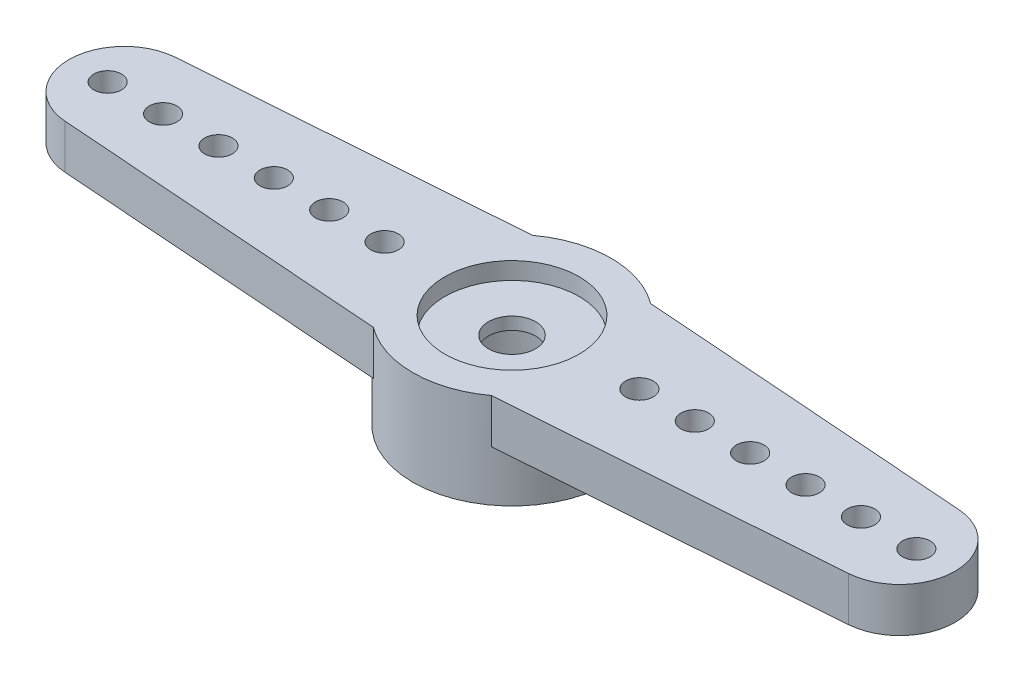
ISO-10303-21;
HEADER;
FILE_DESCRIPTION(('STEP AP214'),'2;1');
FILE_NAME('part.step','',(''),(''),'','','');
FILE_SCHEMA(('AUTOMOTIVE_DESIGN { 1 0 10303 214 1 1 1 1 }'));
ENDSEC;
DATA;
#1=APPLICATION_CONTEXT('core data for automotive mechanical design processes');
#2=APPLICATION_PROTOCOL_DEFINITION('international standard','automotive_design',2000,#1);
#3=PRODUCT_CONTEXT('',#1,'mechanical');
#4=PRODUCT('Part','Part','',(#3));
#5=PRODUCT_RELATED_PRODUCT_CATEGORY('part','',(#4));
#6=PRODUCT_DEFINITION_FORMATION('','',#4);
#7=PRODUCT_DEFINITION_CONTEXT('part definition',#1,'design');
#8=PRODUCT_DEFINITION('design','',#6,#7);
#9=PRODUCT_DEFINITION_SHAPE('','',#8);
#10=(LENGTH_UNIT() NAMED_UNIT(*) SI_UNIT(.MILLI.,.METRE.));
#11=(NAMED_UNIT(*) PLANE_ANGLE_UNIT() SI_UNIT($,.RADIAN.));
#12=(NAMED_UNIT(*) SI_UNIT($,.STERADIAN.) SOLID_ANGLE_UNIT());
#13=UNCERTAINTY_MEASURE_WITH_UNIT(LENGTH_MEASURE(1.E-05),#10,'distance_accuracy_value','');
#14=(GEOMETRIC_REPRESENTATION_CONTEXT(3) GLOBAL_UNCERTAINTY_ASSIGNED_CONTEXT((#13)) GLOBAL_UNIT_ASSIGNED_CONTEXT((#10,
#11,#12)) REPRESENTATION_CONTEXT('',''));
#15=CARTESIAN_POINT('',(0.,0.,0.));
#16=DIRECTION('',(0.,0.,1.));
#17=DIRECTION('',(1.,0.,0.));
#18=AXIS2_PLACEMENT_3D('',#15,#16,#17);
#19=CARTESIAN_POINT('',(3.554,13.2,-3.6));
#20=DIRECTION('',(0.,-1.,0.));
#21=DIRECTION('',(0.,0.,-1.));
#22=AXIS2_PLACEMENT_3D('',#19,#20,#21);
#23=PLANE('',#22);
#24=CARTESIAN_POINT('',(5.9,13.2,-5.9));
#25=DIRECTION('',(0.,1.,0.));
#26=DIRECTION('',(0.,0.,1.));
#27=AXIS2_PLACEMENT_3D('',#24,#25,#26);
#28=CIRCLE('',#27,0.850000000000001);
#29=CARTESIAN_POINT('',(5.9,13.2,-5.05));
#30=VERTEX_POINT('',#29);
#31=EDGE_CURVE('E286',#30,#30,#28,.F.);
#32=ORIENTED_EDGE('',*,*,#31,.F.);
#33=EDGE_LOOP('',(#32));
#34=FACE_BOUND('',#33,.T.);
#35=CARTESIAN_POINT('',(5.9,13.2,-5.9));
#36=DIRECTION('',(0.,-1.,0.));
#37=DIRECTION('',(0.,0.,-1.));
#38=AXIS2_PLACEMENT_3D('',#35,#36,#37);
#39=CIRCLE('',#38,2.3);
#40=CARTESIAN_POINT('',(5.9,13.2,-8.2));
#41=VERTEX_POINT('',#40);
#42=EDGE_CURVE('E29',#41,#41,#39,.F.);
#43=ORIENTED_EDGE('',*,*,#42,.F.);
#44=EDGE_LOOP('',(#43));
#45=FACE_BOUND('',#44,.T.);
#46=ADVANCED_FACE('F25',(#34,#45),#23,.T.);
#47=CARTESIAN_POINT('',(5.9,13.2,-5.9));
#48=DIRECTION('',(0.,-1.,0.));
#49=DIRECTION('',(0.,0.,-1.));
#50=AXIS2_PLACEMENT_3D('',#47,#48,#49);
#51=CYLINDRICAL_SURFACE('',#50,2.3);
#52=ORIENTED_EDGE('',*,*,#42,.T.);
#53=EDGE_LOOP('',(#52));
#54=FACE_BOUND('',#53,.T.);
#55=CARTESIAN_POINT('',(5.9,10.84,-5.9));
#56=DIRECTION('',(0.,-1.,0.));
#57=DIRECTION('',(0.,0.,-1.));
#58=AXIS2_PLACEMENT_3D('',#55,#56,#57);
#59=CIRCLE('',#58,2.3);
#60=CARTESIAN_POINT('',(5.9,10.84,-8.2));
#61=VERTEX_POINT('',#60);
#62=EDGE_CURVE('E283',#61,#61,#59,.F.);
#63=ORIENTED_EDGE('',*,*,#62,.F.);
#64=EDGE_LOOP('',(#63));
#65=FACE_BOUND('',#64,.T.);
#66=ADVANCED_FACE('F295',(#54,#65),#51,.F.);
#67=CARTESIAN_POINT('',(5.9,13.2,-5.9));
#68=DIRECTION('',(0.,1.,0.));
#69=DIRECTION('',(0.,0.,1.));
#70=AXIS2_PLACEMENT_3D('',#67,#68,#69);
#71=CYLINDRICAL_SURFACE('',#70,0.850000000000001);
#72=ORIENTED_EDGE('',*,*,#31,.T.);
#73=EDGE_LOOP('',(#72));
#74=FACE_BOUND('',#73,.T.);
#75=CARTESIAN_POINT('',(5.9,13.65,-5.9));
#76=DIRECTION('',(0.,1.,0.));
#77=DIRECTION('',(0.,0.,1.));
#78=AXIS2_PLACEMENT_3D('',#75,#76,#77);
#79=CIRCLE('',#78,0.850000000000001);
#80=CARTESIAN_POINT('',(5.9,13.65,-5.05));
#81=VERTEX_POINT('',#80);
#82=EDGE_CURVE('E278',#81,#81,#79,.F.);
#83=ORIENTED_EDGE('',*,*,#82,.F.);
#84=EDGE_LOOP('',(#83));
#85=FACE_BOUND('',#84,.T.);
#86=ADVANCED_FACE('F305',(#74,#85),#71,.F.);
#87=CARTESIAN_POINT('',(2.2484,10.84,-2.2484));
#88=DIRECTION('',(0.,-1.,0.));
#89=DIRECTION('',(0.,0.,-1.));
#90=AXIS2_PLACEMENT_3D('',#87,#88,#89);
#91=PLANE('',#90);
#92=ORIENTED_EDGE('',*,*,#62,.T.);
#93=EDGE_LOOP('',(#92));
#94=FACE_BOUND('',#93,.T.);
#95=CARTESIAN_POINT('',(5.9,10.84,-5.9));
#96=DIRECTION('',(0.,1.,0.));
#97=DIRECTION('',(0.,0.,1.));
#98=AXIS2_PLACEMENT_3D('',#95,#96,#97);
#99=CIRCLE('',#98,3.58);
#100=CARTESIAN_POINT('',(5.9,10.84,-2.32));
#101=VERTEX_POINT('',#100);
#102=EDGE_CURVE('E101',#101,#101,#99,.T.);
#103=ORIENTED_EDGE('',*,*,#102,.F.);
#104=EDGE_LOOP('',(#103));
#105=FACE_BOUND('',#104,.T.);
#106=ADVANCED_FACE('F471',(#94,#105),#91,.T.);
#107=CARTESIAN_POINT('',(8.03325455583716,12.67,-3.025));
#108=DIRECTION('',(0.,-1.,0.));
#109=DIRECTION('',(0.,0.,-1.));
#110=AXIS2_PLACEMENT_3D('',#107,#108,#109);
#111=PLANE('',#110);
#112=CARTESIAN_POINT('',(10.5,12.67,-5.9));
#113=DIRECTION('',(0.,-1.,0.));
#114=DIRECTION('',(0.,0.,-1.));
#115=AXIS2_PLACEMENT_3D('',#112,#113,#114);
#116=CIRCLE('',#115,0.500000000000001);
#117=CARTESIAN_POINT('',(10.5,12.67,-6.4));
#118=VERTEX_POINT('',#117);
#119=EDGE_CURVE('E112',#118,#118,#116,.T.);
#120=ORIENTED_EDGE('',*,*,#119,.F.);
#121=EDGE_LOOP('',(#120));
#122=FACE_BOUND('',#121,.T.);
#123=CARTESIAN_POINT('',(14.5,12.67,-5.9));
#124=DIRECTION('',(0.,-1.,0.));
#125=DIRECTION('',(0.,0.,-1.));
#126=AXIS2_PLACEMENT_3D('',#123,#124,#125);
#127=CIRCLE('',#126,0.5);
#128=CARTESIAN_POINT('',(14.5,12.67,-6.4));
#129=VERTEX_POINT('',#128);
#130=EDGE_CURVE('E265',#129,#129,#127,.T.);
#131=ORIENTED_EDGE('',*,*,#130,.F.);
#132=EDGE_LOOP('',(#131));
#133=FACE_BOUND('',#132,.T.);
#134=CARTESIAN_POINT('',(18.5,12.67,-5.9));
#135=DIRECTION('',(0.,-1.,0.));
#136=DIRECTION('',(0.,0.,-1.));
#137=AXIS2_PLACEMENT_3D('',#134,#135,#136);
#138=CIRCLE('',#137,0.499999999999999);
#139=CARTESIAN_POINT('',(18.5,12.67,-6.4));
#140=VERTEX_POINT('',#139);
#141=EDGE_CURVE('E261',#140,#140,#138,.T.);
#142=ORIENTED_EDGE('',*,*,#141,.F.);
#143=EDGE_LOOP('',(#142));
#144=FACE_BOUND('',#143,.T.);
#145=CARTESIAN_POINT('',(20.5,12.67,-5.9));
#146=DIRECTION('',(0.,-1.,0.));
#147=DIRECTION('',(0.,0.,-1.));
#148=AXIS2_PLACEMENT_3D('',#145,#146,#147);
#149=CIRCLE('',#148,0.500000000000002);
#150=CARTESIAN_POINT('',(20.5,12.67,-6.4));
#151=VERTEX_POINT('',#150);
#152=EDGE_CURVE('E257',#151,#151,#149,.T.);
#153=ORIENTED_EDGE('',*,*,#152,.F.);
#154=EDGE_LOOP('',(#153));
#155=FACE_BOUND('',#154,.T.);
#156=CARTESIAN_POINT('',(16.5,12.67,-5.9));
#157=DIRECTION('',(0.,-1.,0.));
#158=DIRECTION('',(0.,0.,-1.));
#159=AXIS2_PLACEMENT_3D('',#156,#157,#158);
#160=CIRCLE('',#159,0.5);
#161=CARTESIAN_POINT('',(16.5,12.67,-6.4));
#162=VERTEX_POINT('',#161);
#163=EDGE_CURVE('E253',#162,#162,#160,.T.);
#164=ORIENTED_EDGE('',*,*,#163,.F.);
#165=EDGE_LOOP('',(#164));
#166=FACE_BOUND('',#165,.T.);
#167=CARTESIAN_POINT('',(12.5,12.67,-5.9));
#168=DIRECTION('',(0.,-1.,0.));
#169=DIRECTION('',(0.,0.,-1.));
#170=AXIS2_PLACEMENT_3D('',#167,#168,#169);
#171=CIRCLE('',#170,0.500000000000001);
#172=CARTESIAN_POINT('',(12.5,12.67,-6.4));
#173=VERTEX_POINT('',#172);
#174=EDGE_CURVE('E249',#173,#173,#171,.T.);
#175=ORIENTED_EDGE('',*,*,#174,.F.);
#176=EDGE_LOOP('',(#175));
#177=FACE_BOUND('',#176,.T.);
#178=DIRECTION('',(-0.997325531387097,0.,-0.0730875122264069));
#179=VECTOR('',#178,1.);
#180=CARTESIAN_POINT('',(14.039714790145,12.67,-8.33482553138709));
#181=LINE('',#180,#179);
#182=CARTESIAN_POINT('',(20.0461750244528,12.67,-7.89465106277419));
#183=VERTEX_POINT('',#182);
#184=CARTESIAN_POINT('',(8.03325455583716,12.67,-8.775));
#185=VERTEX_POINT('',#184);
#186=EDGE_CURVE('E95',#183,#185,#181,.T.);
#187=ORIENTED_EDGE('',*,*,#186,.F.);
#188=CARTESIAN_POINT('',(19.9,12.67,-5.9));
#189=DIRECTION('',(0.,1.,0.));
#190=DIRECTION('',(0.,0.,1.));
#191=AXIS2_PLACEMENT_3D('',#188,#189,#190);
#192=CIRCLE('',#191,2.);
#193=CARTESIAN_POINT('',(20.0461750244528,12.67,-3.9053489372258));
#194=VERTEX_POINT('',#193);
#195=EDGE_CURVE('E119',#194,#183,#192,.T.);
#196=ORIENTED_EDGE('',*,*,#195,.F.);
#197=DIRECTION('',(0.997325531387097,0.,-0.0730875122264059));
#198=VECTOR('',#197,1.);
#199=CARTESIAN_POINT('',(14.039714790145,12.67,-3.4651744686129));
#200=LINE('',#199,#198);
#201=CARTESIAN_POINT('',(8.03325455583716,12.67,-3.025));
#202=VERTEX_POINT('',#201);
#203=EDGE_CURVE('E96',#202,#194,#200,.T.);
#204=ORIENTED_EDGE('',*,*,#203,.F.);
#205=CARTESIAN_POINT('',(5.9,12.67,-5.9));
#206=DIRECTION('',(0.,1.,0.));
#207=DIRECTION('',(0.,0.,1.));
#208=AXIS2_PLACEMENT_3D('',#205,#206,#207);
#209=CIRCLE('',#208,3.58);
#210=EDGE_CURVE('E90',#185,#202,#209,.F.);
#211=ORIENTED_EDGE('',*,*,#210,.F.);
#212=EDGE_LOOP('',(#187,#196,#204,#211));
#213=FACE_BOUND('',#212,.T.);
#214=ADVANCED_FACE('F92',(#122,#133,#144,#155,#166,#177,#213),#111,.T.);
#215=CARTESIAN_POINT('',(3.4265,13.65,-8.325));
#216=DIRECTION('',(0.,1.,0.));
#217=DIRECTION('',(0.,0.,1.));
#218=AXIS2_PLACEMENT_3D('',#215,#216,#217);
#219=PLANE('',#218);
#220=ORIENTED_EDGE('',*,*,#82,.T.);
#221=EDGE_LOOP('',(#220));
#222=FACE_BOUND('',#221,.T.);
#223=CARTESIAN_POINT('',(5.9,13.65,-5.9));
#224=DIRECTION('',(0.,-1.,0.));
#225=DIRECTION('',(0.,0.,-1.));
#226=AXIS2_PLACEMENT_3D('',#223,#224,#225);
#227=CIRCLE('',#226,2.425);
#228=CARTESIAN_POINT('',(5.9,13.65,-8.325));
#229=VERTEX_POINT('',#228);
#230=EDGE_CURVE('E245',#229,#229,#227,.T.);
#231=ORIENTED_EDGE('',*,*,#230,.F.);
#232=EDGE_LOOP('',(#231));
#233=FACE_BOUND('',#232,.T.);
#234=ADVANCED_FACE('F366',(#222,#233),#219,.T.);
#235=CARTESIAN_POINT('',(-8.24617502445281,14.27,-7.8946510627742));
#236=DIRECTION('',(-0.0730875122264059,0.,-0.997325531387097));
#237=DIRECTION('',(0.997325531387097,0.,-0.0730875122264059));
#238=AXIS2_PLACEMENT_3D('',#235,#236,#237);
#239=PLANE('',#238);
#240=DIRECTION('',(0.997325531387097,0.,-0.073087512226406));
#241=VECTOR('',#240,1.);
#242=CARTESIAN_POINT('',(-8.2461750244528,12.67,-7.8946510627742));
#243=LINE('',#242,#241);
#244=CARTESIAN_POINT('',(-8.24617502445281,12.67,-7.8946510627742));
#245=VERTEX_POINT('',#244);
#246=CARTESIAN_POINT('',(3.76674544416284,12.67,-8.775));
#247=VERTEX_POINT('',#246);
#248=EDGE_CURVE('E241',#245,#247,#243,.T.);
#249=ORIENTED_EDGE('',*,*,#248,.F.);
#250=DIRECTION('',(0.,-1.,0.));
#251=VECTOR('',#250,1.);
#252=CARTESIAN_POINT('',(-8.24617502445281,13.47,-7.8946510627742));
#253=LINE('',#252,#251);
#254=CARTESIAN_POINT('',(-8.24617502445281,14.27,-7.8946510627742));
#255=VERTEX_POINT('',#254);
#256=EDGE_CURVE('E282',#255,#245,#253,.T.);
#257=ORIENTED_EDGE('',*,*,#256,.F.);
#258=DIRECTION('',(-0.997325531387097,0.,0.073087512226406));
#259=VECTOR('',#258,1.);
#260=CARTESIAN_POINT('',(3.76674544416284,14.27,-8.775));
#261=LINE('',#260,#259);
#262=CARTESIAN_POINT('',(3.76674544416284,14.27,-8.775));
#263=VERTEX_POINT('',#262);
#264=EDGE_CURVE('E203',#263,#255,#261,.T.);
#265=ORIENTED_EDGE('',*,*,#264,.F.);
#266=DIRECTION('',(0.,1.,0.));
#267=VECTOR('',#266,1.);
#268=CARTESIAN_POINT('',(3.76674544416284,12.555,-8.775));
#269=LINE('',#268,#267);
#270=EDGE_CURVE('E123',#247,#263,#269,.T.);
#271=ORIENTED_EDGE('',*,*,#270,.F.);
#272=EDGE_LOOP('',(#249,#257,#265,#271));
#273=FACE_BOUND('',#272,.T.);
#274=ADVANCED_FACE('F361',(#273),#239,.T.);
#275=CARTESIAN_POINT('',(-8.09999999999999,12.67,-5.9));
#276=DIRECTION('',(0.,1.,0.));
#277=DIRECTION('',(0.,0.,1.));
#278=AXIS2_PLACEMENT_3D('',#275,#276,#277);
#279=CYLINDRICAL_SURFACE('',#278,2.);
#280=CARTESIAN_POINT('',(-8.09999999999999,12.67,-5.9));
#281=DIRECTION('',(0.,1.,0.));
#282=DIRECTION('',(0.,0.,1.));
#283=AXIS2_PLACEMENT_3D('',#280,#281,#282);
#284=CIRCLE('',#283,2.);
#285=CARTESIAN_POINT('',(-8.24617502445281,12.67,-3.90534893722581));
#286=VERTEX_POINT('',#285);
#287=EDGE_CURVE('E229',#286,#245,#284,.F.);
#288=ORIENTED_EDGE('',*,*,#287,.F.);
#289=DIRECTION('',(0.,-1.,0.));
#290=VECTOR('',#289,1.);
#291=CARTESIAN_POINT('',(-8.24617502445281,13.47,-3.90534893722581));
#292=LINE('',#291,#290);
#293=CARTESIAN_POINT('',(-8.24617502445281,14.27,-3.90534893722581));
#294=VERTEX_POINT('',#293);
#295=EDGE_CURVE('E277',#294,#286,#292,.T.);
#296=ORIENTED_EDGE('',*,*,#295,.F.);
#297=CARTESIAN_POINT('',(-8.09999999999999,14.27,-5.9));
#298=DIRECTION('',(0.,1.,0.));
#299=DIRECTION('',(0.,0.,1.));
#300=AXIS2_PLACEMENT_3D('',#297,#298,#299);
#301=CIRCLE('',#300,2.);
#302=EDGE_CURVE('E199',#255,#294,#301,.T.);
#303=ORIENTED_EDGE('',*,*,#302,.F.);
#304=ORIENTED_EDGE('',*,*,#256,.T.);
#305=EDGE_LOOP('',(#288,#296,#303,#304));
#306=FACE_BOUND('',#305,.T.);
#307=ADVANCED_FACE('F345',(#306),#279,.T.);
#308=CARTESIAN_POINT('',(3.76674544416284,14.27,-3.025));
#309=DIRECTION('',(-0.0730875122264067,0.,0.997325531387097));
#310=DIRECTION('',(-0.997325531387097,0.,-0.0730875122264067));
#311=AXIS2_PLACEMENT_3D('',#308,#309,#310);
#312=PLANE('',#311);
#313=DIRECTION('',(-0.997325531387097,0.,-0.0730875122264068));
#314=VECTOR('',#313,1.);
#315=CARTESIAN_POINT('',(3.76674544416284,12.67,-3.025));
#316=LINE('',#315,#314);
#317=CARTESIAN_POINT('',(3.76674544416284,12.67,-3.025));
#318=VERTEX_POINT('',#317);
#319=EDGE_CURVE('E233',#318,#286,#316,.T.);
#320=ORIENTED_EDGE('',*,*,#319,.F.);
#321=DIRECTION('',(0.,-1.,0.));
#322=VECTOR('',#321,1.);
#323=CARTESIAN_POINT('',(3.76674544416284,12.555,-3.025));
#324=LINE('',#323,#322);
#325=CARTESIAN_POINT('',(3.76674544416284,14.27,-3.025));
#326=VERTEX_POINT('',#325);
#327=EDGE_CURVE('E100',#326,#318,#324,.T.);
#328=ORIENTED_EDGE('',*,*,#327,.F.);
#329=DIRECTION('',(0.997325531387097,0.,0.0730875122264067));
#330=VECTOR('',#329,1.);
#331=CARTESIAN_POINT('',(-8.2461750244528,14.27,-3.90534893722581));
#332=LINE('',#331,#330);
#333=EDGE_CURVE('E195',#294,#326,#332,.T.);
#334=ORIENTED_EDGE('',*,*,#333,.F.);
#335=ORIENTED_EDGE('',*,*,#295,.T.);
#336=EDGE_LOOP('',(#320,#328,#334,#335));
#337=FACE_BOUND('',#336,.T.);
#338=ADVANCED_FACE('F337',(#337),#312,.T.);
#339=CARTESIAN_POINT('',(5.9,10.84,-5.9));
#340=DIRECTION('',(0.,1.,0.));
#341=DIRECTION('',(0.,0.,1.));
#342=AXIS2_PLACEMENT_3D('',#339,#340,#341);
#343=CYLINDRICAL_SURFACE('',#342,3.58);
#344=CARTESIAN_POINT('',(5.9,14.27,-5.9));
#345=DIRECTION('',(0.,1.,0.));
#346=DIRECTION('',(0.,0.,1.));
#347=AXIS2_PLACEMENT_3D('',#344,#345,#346);
#348=CIRCLE('',#347,3.58);
#349=CARTESIAN_POINT('',(8.03325455583716,14.27,-8.775));
#350=VERTEX_POINT('',#349);
#351=EDGE_CURVE('E108',#350,#263,#348,.T.);
#352=ORIENTED_EDGE('',*,*,#351,.F.);
#353=DIRECTION('',(0.,1.,0.));
#354=VECTOR('',#353,1.);
#355=CARTESIAN_POINT('',(8.03325455583716,13.47,-8.775));
#356=LINE('',#355,#354);
#357=EDGE_CURVE('E104',#185,#350,#356,.T.);
#358=ORIENTED_EDGE('',*,*,#357,.F.);
#359=ORIENTED_EDGE('',*,*,#210,.T.);
#360=DIRECTION('',(0.,-1.,0.));
#361=VECTOR('',#360,1.);
#362=CARTESIAN_POINT('',(8.03325455583716,13.47,-3.025));
#363=LINE('',#362,#361);
#364=CARTESIAN_POINT('',(8.03325455583716,14.27,-3.025));
#365=VERTEX_POINT('',#364);
#366=EDGE_CURVE('E127',#365,#202,#363,.T.);
#367=ORIENTED_EDGE('',*,*,#366,.F.);
#368=CARTESIAN_POINT('',(5.9,14.27,-5.9));
#369=DIRECTION('',(0.,1.,0.));
#370=DIRECTION('',(0.,0.,1.));
#371=AXIS2_PLACEMENT_3D('',#368,#369,#370);
#372=CIRCLE('',#371,3.58);
#373=EDGE_CURVE('E191',#326,#365,#372,.T.);
#374=ORIENTED_EDGE('',*,*,#373,.F.);
#375=ORIENTED_EDGE('',*,*,#327,.T.);
#376=CARTESIAN_POINT('',(5.9,12.67,-5.9));
#377=DIRECTION('',(0.,1.,0.));
#378=DIRECTION('',(0.,0.,1.));
#379=AXIS2_PLACEMENT_3D('',#376,#377,#378);
#380=CIRCLE('',#379,3.58);
#381=EDGE_CURVE('E237',#247,#318,#380,.T.);
#382=ORIENTED_EDGE('',*,*,#381,.F.);
#383=ORIENTED_EDGE('',*,*,#270,.T.);
#384=EDGE_LOOP('',(#352,#358,#359,#367,#374,#375,#382,#383));
#385=FACE_BOUND('',#384,.T.);
#386=ORIENTED_EDGE('',*,*,#102,.T.);
#387=EDGE_LOOP('',(#386));
#388=FACE_BOUND('',#387,.T.);
#389=ADVANCED_FACE('F105',(#385,#388),#343,.T.);
#390=CARTESIAN_POINT('',(20.0461750244528,14.27,-3.9053489372258));
#391=DIRECTION('',(0.0730875122264059,0.,0.997325531387097));
#392=DIRECTION('',(-0.997325531387097,0.,0.0730875122264059));
#393=AXIS2_PLACEMENT_3D('',#390,#391,#392);
#394=PLANE('',#393);
#395=ORIENTED_EDGE('',*,*,#203,.T.);
#396=DIRECTION('',(0.,-1.,0.));
#397=VECTOR('',#396,1.);
#398=CARTESIAN_POINT('',(20.0461750244528,13.47,-3.9053489372258));
#399=LINE('',#398,#397);
#400=CARTESIAN_POINT('',(20.0461750244528,14.27,-3.9053489372258));
#401=VERTEX_POINT('',#400);
#402=EDGE_CURVE('E126',#401,#194,#399,.T.);
#403=ORIENTED_EDGE('',*,*,#402,.F.);
#404=DIRECTION('',(0.997325531387097,0.,-0.0730875122264058));
#405=VECTOR('',#404,1.);
#406=CARTESIAN_POINT('',(8.03325455583716,14.27,-3.025));
#407=LINE('',#406,#405);
#408=EDGE_CURVE('E187',#365,#401,#407,.T.);
#409=ORIENTED_EDGE('',*,*,#408,.F.);
#410=ORIENTED_EDGE('',*,*,#366,.T.);
#411=EDGE_LOOP('',(#395,#403,#409,#410));
#412=FACE_BOUND('',#411,.T.);
#413=ADVANCED_FACE('F359',(#412),#394,.T.);
#414=CARTESIAN_POINT('',(19.9,12.67,-5.9));
#415=DIRECTION('',(0.,1.,0.));
#416=DIRECTION('',(0.,0.,1.));
#417=AXIS2_PLACEMENT_3D('',#414,#415,#416);
#418=CYLINDRICAL_SURFACE('',#417,2.);
#419=ORIENTED_EDGE('',*,*,#195,.T.);
#420=DIRECTION('',(0.,-1.,0.));
#421=VECTOR('',#420,1.);
#422=CARTESIAN_POINT('',(20.0461750244528,13.47,-7.89465106277419));
#423=LINE('',#422,#421);
#424=CARTESIAN_POINT('',(20.0461750244528,14.27,-7.89465106277419));
#425=VERTEX_POINT('',#424);
#426=EDGE_CURVE('E45',#425,#183,#423,.T.);
#427=ORIENTED_EDGE('',*,*,#426,.F.);
#428=CARTESIAN_POINT('',(19.9,14.27,-5.9));
#429=DIRECTION('',(0.,1.,0.));
#430=DIRECTION('',(0.,0.,1.));
#431=AXIS2_PLACEMENT_3D('',#428,#429,#430);
#432=CIRCLE('',#431,2.);
#433=EDGE_CURVE('E183',#401,#425,#432,.T.);
#434=ORIENTED_EDGE('',*,*,#433,.F.);
#435=ORIENTED_EDGE('',*,*,#402,.T.);
#436=EDGE_LOOP('',(#419,#427,#434,#435));
#437=FACE_BOUND('',#436,.T.);
#438=ADVANCED_FACE('F356',(#437),#418,.T.);
#439=CARTESIAN_POINT('',(8.03325455583716,14.27,-8.775));
#440=DIRECTION('',(0.0730875122264069,0.,-0.997325531387097));
#441=DIRECTION('',(0.997325531387097,0.,0.0730875122264069));
#442=AXIS2_PLACEMENT_3D('',#439,#440,#441);
#443=PLANE('',#442);
#444=ORIENTED_EDGE('',*,*,#186,.T.);
#445=ORIENTED_EDGE('',*,*,#357,.T.);
#446=DIRECTION('',(-0.997325531387097,0.,-0.0730875122264067));
#447=VECTOR('',#446,1.);
#448=CARTESIAN_POINT('',(20.0461750244528,14.27,-7.89465106277419));
#449=LINE('',#448,#447);
#450=EDGE_CURVE('E180',#425,#350,#449,.T.);
#451=ORIENTED_EDGE('',*,*,#450,.F.);
#452=ORIENTED_EDGE('',*,*,#426,.T.);
#453=EDGE_LOOP('',(#444,#445,#451,#452));
#454=FACE_BOUND('',#453,.T.);
#455=ADVANCED_FACE('F114',(#454),#443,.T.);
#456=CARTESIAN_POINT('',(-2.7,14.27,-5.9));
#457=DIRECTION('',(0.,-1.,0.));
#458=DIRECTION('',(0.,0.,-1.));
#459=AXIS2_PLACEMENT_3D('',#456,#457,#458);
#460=CYLINDRICAL_SURFACE('',#459,0.5);
#461=CARTESIAN_POINT('',(-2.7,14.27,-5.9));
#462=DIRECTION('',(0.,-1.,0.));
#463=DIRECTION('',(0.,0.,-1.));
#464=AXIS2_PLACEMENT_3D('',#461,#462,#463);
#465=CIRCLE('',#464,0.5);
#466=CARTESIAN_POINT('',(-2.7,14.27,-6.4));
#467=VERTEX_POINT('',#466);
#468=EDGE_CURVE('E176',#467,#467,#465,.T.);
#469=ORIENTED_EDGE('',*,*,#468,.F.);
#470=EDGE_LOOP('',(#469));
#471=FACE_BOUND('',#470,.T.);
#472=CARTESIAN_POINT('',(-2.7,12.67,-5.9));
#473=DIRECTION('',(0.,-1.,0.));
#474=DIRECTION('',(0.,0.,-1.));
#475=AXIS2_PLACEMENT_3D('',#472,#473,#474);
#476=CIRCLE('',#475,0.5);
#477=CARTESIAN_POINT('',(-2.7,12.67,-6.4));
#478=VERTEX_POINT('',#477);
#479=EDGE_CURVE('E209',#478,#478,#476,.F.);
#480=ORIENTED_EDGE('',*,*,#479,.F.);
#481=EDGE_LOOP('',(#480));
#482=FACE_BOUND('',#481,.T.);
#483=ADVANCED_FACE('F387',(#471,#482),#460,.F.);
#484=CARTESIAN_POINT('',(-6.7,14.27,-5.9));
#485=DIRECTION('',(0.,-1.,0.));
#486=DIRECTION('',(0.,0.,-1.));
#487=AXIS2_PLACEMENT_3D('',#484,#485,#486);
#488=CYLINDRICAL_SURFACE('',#487,0.500000000000001);
#489=CARTESIAN_POINT('',(-6.7,14.27,-5.9));
#490=DIRECTION('',(0.,-1.,0.));
#491=DIRECTION('',(0.,0.,-1.));
#492=AXIS2_PLACEMENT_3D('',#489,#490,#491);
#493=CIRCLE('',#492,0.500000000000001);
#494=CARTESIAN_POINT('',(-6.7,14.27,-6.4));
#495=VERTEX_POINT('',#494);
#496=EDGE_CURVE('E172',#495,#495,#493,.T.);
#497=ORIENTED_EDGE('',*,*,#496,.F.);
#498=EDGE_LOOP('',(#497));
#499=FACE_BOUND('',#498,.T.);
#500=CARTESIAN_POINT('',(-6.7,12.67,-5.9));
#501=DIRECTION('',(0.,-1.,0.));
#502=DIRECTION('',(0.,0.,-1.));
#503=AXIS2_PLACEMENT_3D('',#500,#501,#502);
#504=CIRCLE('',#503,0.500000000000001);
#505=CARTESIAN_POINT('',(-6.7,12.67,-6.4));
#506=VERTEX_POINT('',#505);
#507=EDGE_CURVE('E213',#506,#506,#504,.F.);
#508=ORIENTED_EDGE('',*,*,#507,.F.);
#509=EDGE_LOOP('',(#508));
#510=FACE_BOUND('',#509,.T.);
#511=ADVANCED_FACE('F390',(#499,#510),#488,.F.);
#512=CARTESIAN_POINT('',(-8.7,14.27,-5.9));
#513=DIRECTION('',(0.,-1.,0.));
#514=DIRECTION('',(0.,0.,-1.));
#515=AXIS2_PLACEMENT_3D('',#512,#513,#514);
#516=CYLINDRICAL_SURFACE('',#515,0.500000000000001);
#517=CARTESIAN_POINT('',(-8.7,14.27,-5.9));
#518=DIRECTION('',(0.,-1.,0.));
#519=DIRECTION('',(0.,0.,-1.));
#520=AXIS2_PLACEMENT_3D('',#517,#518,#519);
#521=CIRCLE('',#520,0.500000000000001);
#522=CARTESIAN_POINT('',(-8.7,14.27,-6.4));
#523=VERTEX_POINT('',#522);
#524=EDGE_CURVE('E168',#523,#523,#521,.T.);
#525=ORIENTED_EDGE('',*,*,#524,.F.);
#526=EDGE_LOOP('',(#525));
#527=FACE_BOUND('',#526,.T.);
#528=CARTESIAN_POINT('',(-8.7,12.67,-5.9));
#529=DIRECTION('',(0.,-1.,0.));
#530=DIRECTION('',(0.,0.,-1.));
#531=AXIS2_PLACEMENT_3D('',#528,#529,#530);
#532=CIRCLE('',#531,0.500000000000001);
#533=CARTESIAN_POINT('',(-8.7,12.67,-6.4));
#534=VERTEX_POINT('',#533);
#535=EDGE_CURVE('E217',#534,#534,#532,.F.);
#536=ORIENTED_EDGE('',*,*,#535,.F.);
#537=EDGE_LOOP('',(#536));
#538=FACE_BOUND('',#537,.T.);
#539=ADVANCED_FACE('F394',(#527,#538),#516,.F.);
#540=CARTESIAN_POINT('',(-4.7,14.27,-5.9));
#541=DIRECTION('',(0.,-1.,0.));
#542=DIRECTION('',(0.,0.,-1.));
#543=AXIS2_PLACEMENT_3D('',#540,#541,#542);
#544=CYLINDRICAL_SURFACE('',#543,0.5);
#545=CARTESIAN_POINT('',(-4.7,14.27,-5.9));
#546=DIRECTION('',(0.,-1.,0.));
#547=DIRECTION('',(0.,0.,-1.));
#548=AXIS2_PLACEMENT_3D('',#545,#546,#547);
#549=CIRCLE('',#548,0.5);
#550=CARTESIAN_POINT('',(-4.7,14.27,-6.4));
#551=VERTEX_POINT('',#550);
#552=EDGE_CURVE('E164',#551,#551,#549,.T.);
#553=ORIENTED_EDGE('',*,*,#552,.F.);
#554=EDGE_LOOP('',(#553));
#555=FACE_BOUND('',#554,.T.);
#556=CARTESIAN_POINT('',(-4.7,12.67,-5.9));
#557=DIRECTION('',(0.,-1.,0.));
#558=DIRECTION('',(0.,0.,-1.));
#559=AXIS2_PLACEMENT_3D('',#556,#557,#558);
#560=CIRCLE('',#559,0.5);
#561=CARTESIAN_POINT('',(-4.7,12.67,-6.4));
#562=VERTEX_POINT('',#561);
#563=EDGE_CURVE('E221',#562,#562,#560,.F.);
#564=ORIENTED_EDGE('',*,*,#563,.F.);
#565=EDGE_LOOP('',(#564));
#566=FACE_BOUND('',#565,.T.);
#567=ADVANCED_FACE('F398',(#555,#566),#544,.F.);
#568=CARTESIAN_POINT('',(-0.699999999999997,14.27,-5.9));
#569=DIRECTION('',(0.,-1.,0.));
#570=DIRECTION('',(0.,0.,-1.));
#571=AXIS2_PLACEMENT_3D('',#568,#569,#570);
#572=CYLINDRICAL_SURFACE('',#571,0.500000000000001);
#573=CARTESIAN_POINT('',(-0.699999999999997,14.27,-5.9));
#574=DIRECTION('',(0.,-1.,0.));
#575=DIRECTION('',(0.,0.,-1.));
#576=AXIS2_PLACEMENT_3D('',#573,#574,#575);
#577=CIRCLE('',#576,0.500000000000001);
#578=CARTESIAN_POINT('',(-0.699999999999997,14.27,-6.4));
#579=VERTEX_POINT('',#578);
#580=EDGE_CURVE('E160',#579,#579,#577,.T.);
#581=ORIENTED_EDGE('',*,*,#580,.F.);
#582=EDGE_LOOP('',(#581));
#583=FACE_BOUND('',#582,.T.);
#584=CARTESIAN_POINT('',(-0.699999999999997,12.67,-5.9));
#585=DIRECTION('',(0.,-1.,0.));
#586=DIRECTION('',(0.,0.,-1.));
#587=AXIS2_PLACEMENT_3D('',#584,#585,#586);
#588=CIRCLE('',#587,0.500000000000001);
#589=CARTESIAN_POINT('',(-0.699999999999997,12.67,-6.4));
#590=VERTEX_POINT('',#589);
#591=EDGE_CURVE('E225',#590,#590,#588,.F.);
#592=ORIENTED_EDGE('',*,*,#591,.F.);
#593=EDGE_LOOP('',(#592));
#594=FACE_BOUND('',#593,.T.);
#595=ADVANCED_FACE('F402',(#583,#594),#572,.F.);
#596=CARTESIAN_POINT('',(10.5,14.27,-5.9));
#597=DIRECTION('',(0.,-1.,0.));
#598=DIRECTION('',(0.,0.,-1.));
#599=AXIS2_PLACEMENT_3D('',#596,#597,#598);
#600=CYLINDRICAL_SURFACE('',#599,0.500000000000001);
#601=CARTESIAN_POINT('',(10.5,14.27,-5.9));
#602=DIRECTION('',(0.,-1.,0.));
#603=DIRECTION('',(0.,0.,-1.));
#604=AXIS2_PLACEMENT_3D('',#601,#602,#603);
#605=CIRCLE('',#604,0.500000000000001);
#606=CARTESIAN_POINT('',(10.5,14.27,-6.4));
#607=VERTEX_POINT('',#606);
#608=EDGE_CURVE('E156',#607,#607,#605,.T.);
#609=ORIENTED_EDGE('',*,*,#608,.F.);
#610=EDGE_LOOP('',(#609));
#611=FACE_BOUND('',#610,.T.);
#612=ORIENTED_EDGE('',*,*,#119,.T.);
#613=EDGE_LOOP('',(#612));
#614=FACE_BOUND('',#613,.T.);
#615=ADVANCED_FACE('F406',(#611,#614),#600,.F.);
#616=CARTESIAN_POINT('',(14.5,14.27,-5.9));
#617=DIRECTION('',(0.,-1.,0.));
#618=DIRECTION('',(0.,0.,-1.));
#619=AXIS2_PLACEMENT_3D('',#616,#617,#618);
#620=CYLINDRICAL_SURFACE('',#619,0.5);
#621=CARTESIAN_POINT('',(14.5,14.27,-5.9));
#622=DIRECTION('',(0.,-1.,0.));
#623=DIRECTION('',(0.,0.,-1.));
#624=AXIS2_PLACEMENT_3D('',#621,#622,#623);
#625=CIRCLE('',#624,0.5);
#626=CARTESIAN_POINT('',(14.5,14.27,-6.4));
#627=VERTEX_POINT('',#626);
#628=EDGE_CURVE('E152',#627,#627,#625,.T.);
#629=ORIENTED_EDGE('',*,*,#628,.F.);
#630=EDGE_LOOP('',(#629));
#631=FACE_BOUND('',#630,.T.);
#632=ORIENTED_EDGE('',*,*,#130,.T.);
#633=EDGE_LOOP('',(#632));
#634=FACE_BOUND('',#633,.T.);
#635=ADVANCED_FACE('F410',(#631,#634),#620,.F.);
#636=CARTESIAN_POINT('',(18.5,14.27,-5.9));
#637=DIRECTION('',(0.,-1.,0.));
#638=DIRECTION('',(0.,0.,-1.));
#639=AXIS2_PLACEMENT_3D('',#636,#637,#638);
#640=CYLINDRICAL_SURFACE('',#639,0.499999999999999);
#641=CARTESIAN_POINT('',(18.5,14.27,-5.9));
#642=DIRECTION('',(0.,-1.,0.));
#643=DIRECTION('',(0.,0.,-1.));
#644=AXIS2_PLACEMENT_3D('',#641,#642,#643);
#645=CIRCLE('',#644,0.499999999999999);
#646=CARTESIAN_POINT('',(18.5,14.27,-6.4));
#647=VERTEX_POINT('',#646);
#648=EDGE_CURVE('E148',#647,#647,#645,.T.);
#649=ORIENTED_EDGE('',*,*,#648,.F.);
#650=EDGE_LOOP('',(#649));
#651=FACE_BOUND('',#650,.T.);
#652=ORIENTED_EDGE('',*,*,#141,.T.);
#653=EDGE_LOOP('',(#652));
#654=FACE_BOUND('',#653,.T.);
#655=ADVANCED_FACE('F414',(#651,#654),#640,.F.);
#656=CARTESIAN_POINT('',(20.5,14.27,-5.9));
#657=DIRECTION('',(0.,-1.,0.));
#658=DIRECTION('',(0.,0.,-1.));
#659=AXIS2_PLACEMENT_3D('',#656,#657,#658);
#660=CYLINDRICAL_SURFACE('',#659,0.500000000000002);
#661=CARTESIAN_POINT('',(20.5,14.27,-5.9));
#662=DIRECTION('',(0.,-1.,0.));
#663=DIRECTION('',(0.,0.,-1.));
#664=AXIS2_PLACEMENT_3D('',#661,#662,#663);
#665=CIRCLE('',#664,0.500000000000002);
#666=CARTESIAN_POINT('',(20.5,14.27,-6.4));
#667=VERTEX_POINT('',#666);
#668=EDGE_CURVE('E144',#667,#667,#665,.T.);
#669=ORIENTED_EDGE('',*,*,#668,.F.);
#670=EDGE_LOOP('',(#669));
#671=FACE_BOUND('',#670,.T.);
#672=ORIENTED_EDGE('',*,*,#152,.T.);
#673=EDGE_LOOP('',(#672));
#674=FACE_BOUND('',#673,.T.);
#675=ADVANCED_FACE('F418',(#671,#674),#660,.F.);
#676=CARTESIAN_POINT('',(16.5,14.27,-5.9));
#677=DIRECTION('',(0.,-1.,0.));
#678=DIRECTION('',(0.,0.,-1.));
#679=AXIS2_PLACEMENT_3D('',#676,#677,#678);
#680=CYLINDRICAL_SURFACE('',#679,0.5);
#681=CARTESIAN_POINT('',(16.5,14.27,-5.9));
#682=DIRECTION('',(0.,-1.,0.));
#683=DIRECTION('',(0.,0.,-1.));
#684=AXIS2_PLACEMENT_3D('',#681,#682,#683);
#685=CIRCLE('',#684,0.5);
#686=CARTESIAN_POINT('',(16.5,14.27,-6.4));
#687=VERTEX_POINT('',#686);
#688=EDGE_CURVE('E140',#687,#687,#685,.T.);
#689=ORIENTED_EDGE('',*,*,#688,.F.);
#690=EDGE_LOOP('',(#689));
#691=FACE_BOUND('',#690,.T.);
#692=ORIENTED_EDGE('',*,*,#163,.T.);
#693=EDGE_LOOP('',(#692));
#694=FACE_BOUND('',#693,.T.);
#695=ADVANCED_FACE('F422',(#691,#694),#680,.F.);
#696=CARTESIAN_POINT('',(12.5,14.27,-5.9));
#697=DIRECTION('',(0.,-1.,0.));
#698=DIRECTION('',(0.,0.,-1.));
#699=AXIS2_PLACEMENT_3D('',#696,#697,#698);
#700=CYLINDRICAL_SURFACE('',#699,0.500000000000001);
#701=CARTESIAN_POINT('',(12.5,14.27,-5.9));
#702=DIRECTION('',(0.,-1.,0.));
#703=DIRECTION('',(0.,0.,-1.));
#704=AXIS2_PLACEMENT_3D('',#701,#702,#703);
#705=CIRCLE('',#704,0.500000000000001);
#706=CARTESIAN_POINT('',(12.5,14.27,-6.4));
#707=VERTEX_POINT('',#706);
#708=EDGE_CURVE('E136',#707,#707,#705,.T.);
#709=ORIENTED_EDGE('',*,*,#708,.F.);
#710=EDGE_LOOP('',(#709));
#711=FACE_BOUND('',#710,.T.);
#712=ORIENTED_EDGE('',*,*,#174,.T.);
#713=EDGE_LOOP('',(#712));
#714=FACE_BOUND('',#713,.T.);
#715=ADVANCED_FACE('F426',(#711,#714),#700,.F.);
#716=CARTESIAN_POINT('',(5.9,14.27,-5.9));
#717=DIRECTION('',(0.,-1.,0.));
#718=DIRECTION('',(0.,0.,-1.));
#719=AXIS2_PLACEMENT_3D('',#716,#717,#718);
#720=CYLINDRICAL_SURFACE('',#719,2.425);
#721=ORIENTED_EDGE('',*,*,#230,.T.);
#722=EDGE_LOOP('',(#721));
#723=FACE_BOUND('',#722,.T.);
#724=CARTESIAN_POINT('',(5.9,14.27,-5.9));
#725=DIRECTION('',(0.,-1.,0.));
#726=DIRECTION('',(0.,0.,-1.));
#727=AXIS2_PLACEMENT_3D('',#724,#725,#726);
#728=CIRCLE('',#727,2.425);
#729=CARTESIAN_POINT('',(5.9,14.27,-8.325));
#730=VERTEX_POINT('',#729);
#731=EDGE_CURVE('E132',#730,#730,#728,.T.);
#732=ORIENTED_EDGE('',*,*,#731,.F.);
#733=EDGE_LOOP('',(#732));
#734=FACE_BOUND('',#733,.T.);
#735=ADVANCED_FACE('F321',(#723,#734),#720,.F.);
#736=CARTESIAN_POINT('',(-10.2386674544416,12.67,-3.025));
#737=DIRECTION('',(0.,-1.,0.));
#738=DIRECTION('',(0.,0.,-1.));
#739=AXIS2_PLACEMENT_3D('',#736,#737,#738);
#740=PLANE('',#739);
#741=CARTESIAN_POINT('',(1.3,12.67,-5.9));
#742=DIRECTION('',(0.,-1.,0.));
#743=DIRECTION('',(0.,0.,-1.));
#744=AXIS2_PLACEMENT_3D('',#741,#742,#743);
#745=CIRCLE('',#744,0.5);
#746=CARTESIAN_POINT('',(1.3,12.67,-6.4));
#747=VERTEX_POINT('',#746);
#748=EDGE_CURVE('E36',#747,#747,#745,.T.);
#749=ORIENTED_EDGE('',*,*,#748,.F.);
#750=EDGE_LOOP('',(#749));
#751=FACE_BOUND('',#750,.T.);
#752=ORIENTED_EDGE('',*,*,#479,.T.);
#753=EDGE_LOOP('',(#752));
#754=FACE_BOUND('',#753,.T.);
#755=ORIENTED_EDGE('',*,*,#507,.T.);
#756=EDGE_LOOP('',(#755));
#757=FACE_BOUND('',#756,.T.);
#758=ORIENTED_EDGE('',*,*,#535,.T.);
#759=EDGE_LOOP('',(#758));
#760=FACE_BOUND('',#759,.T.);
#761=ORIENTED_EDGE('',*,*,#563,.T.);
#762=EDGE_LOOP('',(#761));
#763=FACE_BOUND('',#762,.T.);
#764=ORIENTED_EDGE('',*,*,#591,.T.);
#765=EDGE_LOOP('',(#764));
#766=FACE_BOUND('',#765,.T.);
#767=ORIENTED_EDGE('',*,*,#319,.T.);
#768=ORIENTED_EDGE('',*,*,#287,.T.);
#769=ORIENTED_EDGE('',*,*,#248,.T.);
#770=ORIENTED_EDGE('',*,*,#381,.T.);
#771=EDGE_LOOP('',(#767,#768,#769,#770));
#772=FACE_BOUND('',#771,.T.);
#773=ADVANCED_FACE('F313',(#751,#754,#757,#760,#763,#766,#772),#740,.T.);
#774=CARTESIAN_POINT('',(-10.42,14.27,-10.3578782608696));
#775=DIRECTION('',(0.,1.,0.));
#776=DIRECTION('',(0.,0.,1.));
#777=AXIS2_PLACEMENT_3D('',#774,#775,#776);
#778=PLANE('',#777);
#779=ORIENTED_EDGE('',*,*,#731,.T.);
#780=EDGE_LOOP('',(#779));
#781=FACE_BOUND('',#780,.T.);
#782=ORIENTED_EDGE('',*,*,#708,.T.);
#783=EDGE_LOOP('',(#782));
#784=FACE_BOUND('',#783,.T.);
#785=ORIENTED_EDGE('',*,*,#688,.T.);
#786=EDGE_LOOP('',(#785));
#787=FACE_BOUND('',#786,.T.);
#788=ORIENTED_EDGE('',*,*,#668,.T.);
#789=EDGE_LOOP('',(#788));
#790=FACE_BOUND('',#789,.T.);
#791=ORIENTED_EDGE('',*,*,#648,.T.);
#792=EDGE_LOOP('',(#791));
#793=FACE_BOUND('',#792,.T.);
#794=ORIENTED_EDGE('',*,*,#628,.T.);
#795=EDGE_LOOP('',(#794));
#796=FACE_BOUND('',#795,.T.);
#797=ORIENTED_EDGE('',*,*,#608,.T.);
#798=EDGE_LOOP('',(#797));
#799=FACE_BOUND('',#798,.T.);
#800=ORIENTED_EDGE('',*,*,#580,.T.);
#801=EDGE_LOOP('',(#800));
#802=FACE_BOUND('',#801,.T.);
#803=ORIENTED_EDGE('',*,*,#552,.T.);
#804=EDGE_LOOP('',(#803));
#805=FACE_BOUND('',#804,.T.);
#806=ORIENTED_EDGE('',*,*,#524,.T.);
#807=EDGE_LOOP('',(#806));
#808=FACE_BOUND('',#807,.T.);
#809=ORIENTED_EDGE('',*,*,#496,.T.);
#810=EDGE_LOOP('',(#809));
#811=FACE_BOUND('',#810,.T.);
#812=ORIENTED_EDGE('',*,*,#468,.T.);
#813=EDGE_LOOP('',(#812));
#814=FACE_BOUND('',#813,.T.);
#815=CARTESIAN_POINT('',(1.3,14.27,-5.9));
#816=DIRECTION('',(0.,-1.,0.));
#817=DIRECTION('',(0.,0.,-1.));
#818=AXIS2_PLACEMENT_3D('',#815,#816,#817);
#819=CIRCLE('',#818,0.5);
#820=CARTESIAN_POINT('',(1.3,14.27,-6.4));
#821=VERTEX_POINT('',#820);
#822=EDGE_CURVE('E13',#821,#821,#819,.F.);
#823=ORIENTED_EDGE('',*,*,#822,.F.);
#824=EDGE_LOOP('',(#823));
#825=FACE_BOUND('',#824,.T.);
#826=ORIENTED_EDGE('',*,*,#433,.T.);
#827=ORIENTED_EDGE('',*,*,#450,.T.);
#828=ORIENTED_EDGE('',*,*,#351,.T.);
#829=ORIENTED_EDGE('',*,*,#264,.T.);
#830=ORIENTED_EDGE('',*,*,#302,.T.);
#831=ORIENTED_EDGE('',*,*,#333,.T.);
#832=ORIENTED_EDGE('',*,*,#373,.T.);
#833=ORIENTED_EDGE('',*,*,#408,.T.);
#834=EDGE_LOOP('',(#826,#827,#828,#829,#830,#831,#832,#833));
#835=FACE_BOUND('',#834,.T.);
#836=ADVANCED_FACE('F308',(#781,#784,#787,#790,#793,#796,#799,#802,#805,#808,#811,#814,#825,
#835),#778,.T.);
#837=CARTESIAN_POINT('',(1.3,14.27,-5.9));
#838=DIRECTION('',(0.,-1.,0.));
#839=DIRECTION('',(0.,0.,-1.));
#840=AXIS2_PLACEMENT_3D('',#837,#838,#839);
#841=CYLINDRICAL_SURFACE('',#840,0.5);
#842=ORIENTED_EDGE('',*,*,#822,.T.);
#843=EDGE_LOOP('',(#842));
#844=FACE_BOUND('',#843,.T.);
#845=ORIENTED_EDGE('',*,*,#748,.T.);
#846=EDGE_LOOP('',(#845));
#847=FACE_BOUND('',#846,.T.);
#848=ADVANCED_FACE('F27',(#844,#847),#841,.F.);
#849=CLOSED_SHELL('',(#46,#66,#86,#106,#214,#234,#274,#307,#338,#389,#413,#438,#455,#483,#511,
#539,#567,#595,#615,#635,#655,#675,#695,#715,#735,#773,#836,#848));
#850=MANIFOLD_SOLID_BREP('B1',#849);
#851=ADVANCED_BREP_SHAPE_REPRESENTATION('',(#18,#850),#14);
#852=SHAPE_DEFINITION_REPRESENTATION(#9,#851);
ENDSEC;
END-ISO-10303-21;
